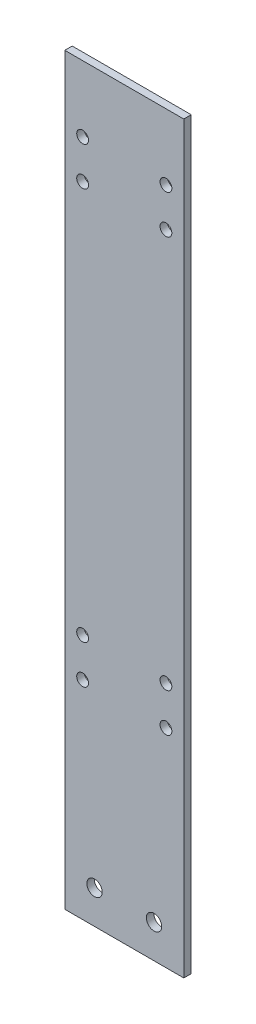
ISO-10303-21;
HEADER;
FILE_DESCRIPTION(('STEP AP214'),'2;1');
FILE_NAME('part.step','',(''),(''),'','','');
FILE_SCHEMA(('AUTOMOTIVE_DESIGN { 1 0 10303 214 1 1 1 1 }'));
ENDSEC;
DATA;
#1=APPLICATION_CONTEXT('core data for automotive mechanical design processes');
#2=APPLICATION_PROTOCOL_DEFINITION('international standard','automotive_design',2000,#1);
#3=PRODUCT_CONTEXT('',#1,'mechanical');
#4=PRODUCT('Part','Part','',(#3));
#5=PRODUCT_RELATED_PRODUCT_CATEGORY('part','',(#4));
#6=PRODUCT_DEFINITION_FORMATION('','',#4);
#7=PRODUCT_DEFINITION_CONTEXT('part definition',#1,'design');
#8=PRODUCT_DEFINITION('design','',#6,#7);
#9=PRODUCT_DEFINITION_SHAPE('','',#8);
#10=(LENGTH_UNIT() NAMED_UNIT(*) SI_UNIT(.MILLI.,.METRE.));
#11=(NAMED_UNIT(*) PLANE_ANGLE_UNIT() SI_UNIT($,.RADIAN.));
#12=(NAMED_UNIT(*) SI_UNIT($,.STERADIAN.) SOLID_ANGLE_UNIT());
#13=UNCERTAINTY_MEASURE_WITH_UNIT(LENGTH_MEASURE(1.E-05),#10,'distance_accuracy_value','');
#14=(GEOMETRIC_REPRESENTATION_CONTEXT(3) GLOBAL_UNCERTAINTY_ASSIGNED_CONTEXT((#13)) GLOBAL_UNIT_ASSIGNED_CONTEXT((#10,
#11,#12)) REPRESENTATION_CONTEXT('',''));
#15=CARTESIAN_POINT('',(0.,0.,0.));
#16=DIRECTION('',(0.,0.,1.));
#17=DIRECTION('',(1.,0.,0.));
#18=AXIS2_PLACEMENT_3D('',#15,#16,#17);
#19=CARTESIAN_POINT('',(0.,635.,0.));
#20=DIRECTION('',(1.,0.,0.));
#21=DIRECTION('',(0.,0.,-1.));
#22=AXIS2_PLACEMENT_3D('',#19,#20,#21);
#23=PLANE('',#22);
#24=DIRECTION('',(0.,0.,1.));
#25=VECTOR('',#24,1.);
#26=CARTESIAN_POINT('',(0.,0.,0.));
#27=LINE('',#26,#25);
#28=CARTESIAN_POINT('',(0.,0.,-6.35));
#29=VERTEX_POINT('',#28);
#30=CARTESIAN_POINT('',(0.,0.,0.));
#31=VERTEX_POINT('',#30);
#32=EDGE_CURVE('E112',#29,#31,#27,.T.);
#33=ORIENTED_EDGE('',*,*,#32,.T.);
#34=DIRECTION('',(0.,-1.,0.));
#35=VECTOR('',#34,1.);
#36=CARTESIAN_POINT('',(0.,635.,0.));
#37=LINE('',#36,#35);
#38=CARTESIAN_POINT('',(0.,635.,0.));
#39=VERTEX_POINT('',#38);
#40=EDGE_CURVE('E11',#39,#31,#37,.T.);
#41=ORIENTED_EDGE('',*,*,#40,.F.);
#42=DIRECTION('',(0.,0.,1.));
#43=VECTOR('',#42,1.);
#44=CARTESIAN_POINT('',(0.,635.,0.));
#45=LINE('',#44,#43);
#46=CARTESIAN_POINT('',(0.,635.,-6.35));
#47=VERTEX_POINT('',#46);
#48=EDGE_CURVE('E96',#47,#39,#45,.T.);
#49=ORIENTED_EDGE('',*,*,#48,.F.);
#50=DIRECTION('',(0.,-1.,0.));
#51=VECTOR('',#50,1.);
#52=CARTESIAN_POINT('',(0.,635.,-6.35));
#53=LINE('',#52,#51);
#54=EDGE_CURVE('E108',#47,#29,#53,.T.);
#55=ORIENTED_EDGE('',*,*,#54,.T.);
#56=EDGE_LOOP('',(#33,#41,#49,#55));
#57=FACE_BOUND('',#56,.T.);
#58=ADVANCED_FACE('F44',(#57),#23,.F.);
#59=CARTESIAN_POINT('',(0.,635.,0.));
#60=DIRECTION('',(0.,0.,-1.));
#61=DIRECTION('',(-1.,0.,0.));
#62=AXIS2_PLACEMENT_3D('',#59,#60,#61);
#63=PLANE('',#62);
#64=CARTESIAN_POINT('',(86.36,177.292,0.));
#65=DIRECTION('',(0.,0.,1.));
#66=DIRECTION('',(1.,0.,0.));
#67=AXIS2_PLACEMENT_3D('',#64,#65,#66);
#68=CIRCLE('',#67,5.0419);
#69=CARTESIAN_POINT('',(91.4019,177.292,0.));
#70=VERTEX_POINT('',#69);
#71=EDGE_CURVE('E162',#70,#70,#68,.T.);
#72=ORIENTED_EDGE('',*,*,#71,.F.);
#73=EDGE_LOOP('',(#72));
#74=FACE_BOUND('',#73,.T.);
#75=CARTESIAN_POINT('',(15.24,578.612,0.));
#76=DIRECTION('',(0.,0.,1.));
#77=DIRECTION('',(1.,0.,0.));
#78=AXIS2_PLACEMENT_3D('',#75,#76,#77);
#79=CIRCLE('',#78,5.0419);
#80=CARTESIAN_POINT('',(20.2819,578.612,0.));
#81=VERTEX_POINT('',#80);
#82=EDGE_CURVE('E177',#81,#81,#79,.T.);
#83=ORIENTED_EDGE('',*,*,#82,.F.);
#84=EDGE_LOOP('',(#83));
#85=FACE_BOUND('',#84,.T.);
#86=CARTESIAN_POINT('',(15.24,545.592,0.));
#87=DIRECTION('',(0.,0.,1.));
#88=DIRECTION('',(1.,0.,0.));
#89=AXIS2_PLACEMENT_3D('',#86,#87,#88);
#90=CIRCLE('',#89,5.0419);
#91=CARTESIAN_POINT('',(20.2819,545.592,0.));
#92=VERTEX_POINT('',#91);
#93=EDGE_CURVE('E178',#92,#92,#90,.T.);
#94=ORIENTED_EDGE('',*,*,#93,.F.);
#95=EDGE_LOOP('',(#94));
#96=FACE_BOUND('',#95,.T.);
#97=CARTESIAN_POINT('',(86.36,578.612,0.));
#98=DIRECTION('',(0.,0.,1.));
#99=DIRECTION('',(1.,0.,0.));
#100=AXIS2_PLACEMENT_3D('',#97,#98,#99);
#101=CIRCLE('',#100,5.0419);
#102=CARTESIAN_POINT('',(91.4019,578.612,0.));
#103=VERTEX_POINT('',#102);
#104=EDGE_CURVE('E193',#103,#103,#101,.T.);
#105=ORIENTED_EDGE('',*,*,#104,.F.);
#106=EDGE_LOOP('',(#105));
#107=FACE_BOUND('',#106,.T.);
#108=CARTESIAN_POINT('',(76.2,28.575,0.));
#109=DIRECTION('',(0.,0.,1.));
#110=DIRECTION('',(-1.,0.,0.));
#111=AXIS2_PLACEMENT_3D('',#108,#109,#110);
#112=CIRCLE('',#111,6.54811999999999);
#113=CARTESIAN_POINT('',(69.65188,28.575,0.));
#114=VERTEX_POINT('',#113);
#115=EDGE_CURVE('E137',#114,#114,#112,.T.);
#116=ORIENTED_EDGE('',*,*,#115,.F.);
#117=EDGE_LOOP('',(#116));
#118=FACE_BOUND('',#117,.T.);
#119=CARTESIAN_POINT('',(15.24,210.312,0.));
#120=DIRECTION('',(0.,0.,1.));
#121=DIRECTION('',(1.,0.,0.));
#122=AXIS2_PLACEMENT_3D('',#119,#120,#121);
#123=CIRCLE('',#122,5.04189999999999);
#124=CARTESIAN_POINT('',(20.2819,210.312,0.));
#125=VERTEX_POINT('',#124);
#126=EDGE_CURVE('E145',#125,#125,#123,.T.);
#127=ORIENTED_EDGE('',*,*,#126,.F.);
#128=EDGE_LOOP('',(#127));
#129=FACE_BOUND('',#128,.T.);
#130=CARTESIAN_POINT('',(86.36,210.312,0.));
#131=DIRECTION('',(0.,0.,1.));
#132=DIRECTION('',(1.,0.,0.));
#133=AXIS2_PLACEMENT_3D('',#130,#131,#132);
#134=CIRCLE('',#133,5.0419);
#135=CARTESIAN_POINT('',(91.4019,210.312,0.));
#136=VERTEX_POINT('',#135);
#137=EDGE_CURVE('E146',#136,#136,#134,.T.);
#138=ORIENTED_EDGE('',*,*,#137,.F.);
#139=EDGE_LOOP('',(#138));
#140=FACE_BOUND('',#139,.T.);
#141=CARTESIAN_POINT('',(15.24,177.292,0.));
#142=DIRECTION('',(0.,0.,1.));
#143=DIRECTION('',(1.,0.,0.));
#144=AXIS2_PLACEMENT_3D('',#141,#142,#143);
#145=CIRCLE('',#144,5.04189999999999);
#146=CARTESIAN_POINT('',(20.2819,177.292,0.));
#147=VERTEX_POINT('',#146);
#148=EDGE_CURVE('E161',#147,#147,#145,.T.);
#149=ORIENTED_EDGE('',*,*,#148,.F.);
#150=EDGE_LOOP('',(#149));
#151=FACE_BOUND('',#150,.T.);
#152=CARTESIAN_POINT('',(86.36,545.592,0.));
#153=DIRECTION('',(0.,0.,1.));
#154=DIRECTION('',(1.,0.,0.));
#155=AXIS2_PLACEMENT_3D('',#152,#153,#154);
#156=CIRCLE('',#155,5.0419);
#157=CARTESIAN_POINT('',(91.4019,545.592,0.));
#158=VERTEX_POINT('',#157);
#159=EDGE_CURVE('E194',#158,#158,#156,.T.);
#160=ORIENTED_EDGE('',*,*,#159,.F.);
#161=EDGE_LOOP('',(#160));
#162=FACE_BOUND('',#161,.T.);
#163=CARTESIAN_POINT('',(25.4,28.575,0.));
#164=DIRECTION('',(0.,0.,1.));
#165=DIRECTION('',(1.,0.,0.));
#166=AXIS2_PLACEMENT_3D('',#163,#164,#165);
#167=CIRCLE('',#166,6.54812);
#168=CARTESIAN_POINT('',(31.94812,28.575,0.));
#169=VERTEX_POINT('',#168);
#170=EDGE_CURVE('E133',#169,#169,#167,.T.);
#171=ORIENTED_EDGE('',*,*,#170,.F.);
#172=EDGE_LOOP('',(#171));
#173=FACE_BOUND('',#172,.T.);
#174=DIRECTION('',(1.,0.,0.));
#175=VECTOR('',#174,1.);
#176=CARTESIAN_POINT('',(0.,0.,0.));
#177=LINE('',#176,#175);
#178=CARTESIAN_POINT('',(101.6,0.,0.));
#179=VERTEX_POINT('',#178);
#180=EDGE_CURVE('E101',#31,#179,#177,.T.);
#181=ORIENTED_EDGE('',*,*,#180,.T.);
#182=DIRECTION('',(0.,-1.,0.));
#183=VECTOR('',#182,1.);
#184=CARTESIAN_POINT('',(101.6,635.,0.));
#185=LINE('',#184,#183);
#186=CARTESIAN_POINT('',(101.6,635.,0.));
#187=VERTEX_POINT('',#186);
#188=EDGE_CURVE('E53',#187,#179,#185,.T.);
#189=ORIENTED_EDGE('',*,*,#188,.F.);
#190=DIRECTION('',(1.,0.,0.));
#191=VECTOR('',#190,1.);
#192=CARTESIAN_POINT('',(0.,635.,0.));
#193=LINE('',#192,#191);
#194=EDGE_CURVE('E91',#39,#187,#193,.T.);
#195=ORIENTED_EDGE('',*,*,#194,.F.);
#196=ORIENTED_EDGE('',*,*,#40,.T.);
#197=EDGE_LOOP('',(#181,#189,#195,#196));
#198=FACE_BOUND('',#197,.T.);
#199=ADVANCED_FACE('F100',(#74,#85,#96,#107,#118,#129,#140,#151,#162,#173,#198),#63,.F.);
#200=CARTESIAN_POINT('',(101.6,635.,0.));
#201=DIRECTION('',(-1.,0.,0.));
#202=DIRECTION('',(0.,0.,1.));
#203=AXIS2_PLACEMENT_3D('',#200,#201,#202);
#204=PLANE('',#203);
#205=DIRECTION('',(0.,0.,-1.));
#206=VECTOR('',#205,1.);
#207=CARTESIAN_POINT('',(101.6,0.,0.));
#208=LINE('',#207,#206);
#209=CARTESIAN_POINT('',(101.6,0.,-6.35));
#210=VERTEX_POINT('',#209);
#211=EDGE_CURVE('E78',#179,#210,#208,.T.);
#212=ORIENTED_EDGE('',*,*,#211,.T.);
#213=DIRECTION('',(0.,-1.,0.));
#214=VECTOR('',#213,1.);
#215=CARTESIAN_POINT('',(101.6,635.,-6.35));
#216=LINE('',#215,#214);
#217=CARTESIAN_POINT('',(101.6,635.,-6.35));
#218=VERTEX_POINT('',#217);
#219=EDGE_CURVE('E103',#218,#210,#216,.T.);
#220=ORIENTED_EDGE('',*,*,#219,.F.);
#221=DIRECTION('',(0.,0.,-1.));
#222=VECTOR('',#221,1.);
#223=CARTESIAN_POINT('',(101.6,635.,0.));
#224=LINE('',#223,#222);
#225=EDGE_CURVE('E94',#187,#218,#224,.T.);
#226=ORIENTED_EDGE('',*,*,#225,.F.);
#227=ORIENTED_EDGE('',*,*,#188,.T.);
#228=EDGE_LOOP('',(#212,#220,#226,#227));
#229=FACE_BOUND('',#228,.T.);
#230=ADVANCED_FACE('F104',(#229),#204,.F.);
#231=CARTESIAN_POINT('',(0.,635.,-6.35));
#232=DIRECTION('',(0.,0.,1.));
#233=DIRECTION('',(1.,0.,0.));
#234=AXIS2_PLACEMENT_3D('',#231,#232,#233);
#235=PLANE('',#234);
#236=CARTESIAN_POINT('',(86.36,177.292,-6.35));
#237=DIRECTION('',(0.,0.,1.));
#238=DIRECTION('',(1.,0.,0.));
#239=AXIS2_PLACEMENT_3D('',#236,#237,#238);
#240=CIRCLE('',#239,5.0419);
#241=CARTESIAN_POINT('',(91.4019,177.292,-6.35));
#242=VERTEX_POINT('',#241);
#243=EDGE_CURVE('E182',#242,#242,#240,.T.);
#244=ORIENTED_EDGE('',*,*,#243,.T.);
#245=EDGE_LOOP('',(#244));
#246=FACE_BOUND('',#245,.T.);
#247=CARTESIAN_POINT('',(15.24,578.612,-6.35));
#248=DIRECTION('',(0.,0.,1.));
#249=DIRECTION('',(1.,0.,0.));
#250=AXIS2_PLACEMENT_3D('',#247,#248,#249);
#251=CIRCLE('',#250,5.0419);
#252=CARTESIAN_POINT('',(20.2819,578.612,-6.35));
#253=VERTEX_POINT('',#252);
#254=EDGE_CURVE('E173',#253,#253,#251,.T.);
#255=ORIENTED_EDGE('',*,*,#254,.T.);
#256=EDGE_LOOP('',(#255));
#257=FACE_BOUND('',#256,.T.);
#258=CARTESIAN_POINT('',(15.24,545.592,-6.35));
#259=DIRECTION('',(0.,0.,1.));
#260=DIRECTION('',(1.,0.,0.));
#261=AXIS2_PLACEMENT_3D('',#258,#259,#260);
#262=CIRCLE('',#261,5.0419);
#263=CARTESIAN_POINT('',(20.2819,545.592,-6.35));
#264=VERTEX_POINT('',#263);
#265=EDGE_CURVE('E198',#264,#264,#262,.T.);
#266=ORIENTED_EDGE('',*,*,#265,.T.);
#267=EDGE_LOOP('',(#266));
#268=FACE_BOUND('',#267,.T.);
#269=CARTESIAN_POINT('',(86.36,578.612,-6.35));
#270=DIRECTION('',(0.,0.,1.));
#271=DIRECTION('',(1.,0.,0.));
#272=AXIS2_PLACEMENT_3D('',#269,#270,#271);
#273=CIRCLE('',#272,5.0419);
#274=CARTESIAN_POINT('',(91.4019,578.612,-6.35));
#275=VERTEX_POINT('',#274);
#276=EDGE_CURVE('E189',#275,#275,#273,.T.);
#277=ORIENTED_EDGE('',*,*,#276,.T.);
#278=EDGE_LOOP('',(#277));
#279=FACE_BOUND('',#278,.T.);
#280=CARTESIAN_POINT('',(76.2,28.575,-6.35));
#281=DIRECTION('',(0.,0.,1.));
#282=DIRECTION('',(-1.,0.,0.));
#283=AXIS2_PLACEMENT_3D('',#280,#281,#282);
#284=CIRCLE('',#283,6.54811999999999);
#285=CARTESIAN_POINT('',(69.65188,28.575,-6.35));
#286=VERTEX_POINT('',#285);
#287=EDGE_CURVE('E150',#286,#286,#284,.T.);
#288=ORIENTED_EDGE('',*,*,#287,.T.);
#289=EDGE_LOOP('',(#288));
#290=FACE_BOUND('',#289,.T.);
#291=CARTESIAN_POINT('',(15.24,210.312,-6.35));
#292=DIRECTION('',(0.,0.,1.));
#293=DIRECTION('',(1.,0.,0.));
#294=AXIS2_PLACEMENT_3D('',#291,#292,#293);
#295=CIRCLE('',#294,5.04189999999999);
#296=CARTESIAN_POINT('',(20.2819,210.312,-6.35));
#297=VERTEX_POINT('',#296);
#298=EDGE_CURVE('E141',#297,#297,#295,.T.);
#299=ORIENTED_EDGE('',*,*,#298,.T.);
#300=EDGE_LOOP('',(#299));
#301=FACE_BOUND('',#300,.T.);
#302=CARTESIAN_POINT('',(86.36,210.312,-6.35));
#303=DIRECTION('',(0.,0.,1.));
#304=DIRECTION('',(1.,0.,0.));
#305=AXIS2_PLACEMENT_3D('',#302,#303,#304);
#306=CIRCLE('',#305,5.0419);
#307=CARTESIAN_POINT('',(91.4019,210.312,-6.35));
#308=VERTEX_POINT('',#307);
#309=EDGE_CURVE('E166',#308,#308,#306,.T.);
#310=ORIENTED_EDGE('',*,*,#309,.T.);
#311=EDGE_LOOP('',(#310));
#312=FACE_BOUND('',#311,.T.);
#313=CARTESIAN_POINT('',(15.24,177.292,-6.35));
#314=DIRECTION('',(0.,0.,1.));
#315=DIRECTION('',(1.,0.,0.));
#316=AXIS2_PLACEMENT_3D('',#313,#314,#315);
#317=CIRCLE('',#316,5.04189999999999);
#318=CARTESIAN_POINT('',(20.2819,177.292,-6.35));
#319=VERTEX_POINT('',#318);
#320=EDGE_CURVE('E157',#319,#319,#317,.T.);
#321=ORIENTED_EDGE('',*,*,#320,.T.);
#322=EDGE_LOOP('',(#321));
#323=FACE_BOUND('',#322,.T.);
#324=CARTESIAN_POINT('',(86.36,545.592,-6.35));
#325=DIRECTION('',(0.,0.,1.));
#326=DIRECTION('',(1.,0.,0.));
#327=AXIS2_PLACEMENT_3D('',#324,#325,#326);
#328=CIRCLE('',#327,5.0419);
#329=CARTESIAN_POINT('',(91.4019,545.592,-6.35));
#330=VERTEX_POINT('',#329);
#331=EDGE_CURVE('E205',#330,#330,#328,.T.);
#332=ORIENTED_EDGE('',*,*,#331,.T.);
#333=EDGE_LOOP('',(#332));
#334=FACE_BOUND('',#333,.T.);
#335=CARTESIAN_POINT('',(25.4,28.575,-6.35));
#336=DIRECTION('',(0.,0.,1.));
#337=DIRECTION('',(1.,0.,0.));
#338=AXIS2_PLACEMENT_3D('',#335,#336,#337);
#339=CIRCLE('',#338,6.54812);
#340=CARTESIAN_POINT('',(31.94812,28.575,-6.35));
#341=VERTEX_POINT('',#340);
#342=EDGE_CURVE('E116',#341,#341,#339,.T.);
#343=ORIENTED_EDGE('',*,*,#342,.T.);
#344=EDGE_LOOP('',(#343));
#345=FACE_BOUND('',#344,.T.);
#346=DIRECTION('',(-1.,0.,0.));
#347=VECTOR('',#346,1.);
#348=CARTESIAN_POINT('',(0.,0.,-6.35));
#349=LINE('',#348,#347);
#350=EDGE_CURVE('E84',#210,#29,#349,.T.);
#351=ORIENTED_EDGE('',*,*,#350,.T.);
#352=ORIENTED_EDGE('',*,*,#54,.F.);
#353=DIRECTION('',(-1.,0.,0.));
#354=VECTOR('',#353,1.);
#355=CARTESIAN_POINT('',(0.,635.,-6.35));
#356=LINE('',#355,#354);
#357=EDGE_CURVE('E61',#218,#47,#356,.T.);
#358=ORIENTED_EDGE('',*,*,#357,.F.);
#359=ORIENTED_EDGE('',*,*,#219,.T.);
#360=EDGE_LOOP('',(#351,#352,#358,#359));
#361=FACE_BOUND('',#360,.T.);
#362=ADVANCED_FACE('F126',(#246,#257,#268,#279,#290,#301,#312,#323,#334,#345,#361),#235,.F.);
#363=CARTESIAN_POINT('',(0.,635.,0.));
#364=DIRECTION('',(0.,-1.,0.));
#365=DIRECTION('',(0.,0.,-1.));
#366=AXIS2_PLACEMENT_3D('',#363,#364,#365);
#367=PLANE('',#366);
#368=ORIENTED_EDGE('',*,*,#48,.T.);
#369=ORIENTED_EDGE('',*,*,#194,.T.);
#370=ORIENTED_EDGE('',*,*,#225,.T.);
#371=ORIENTED_EDGE('',*,*,#357,.T.);
#372=EDGE_LOOP('',(#368,#369,#370,#371));
#373=FACE_BOUND('',#372,.T.);
#374=ADVANCED_FACE('F92',(#373),#367,.F.);
#375=CARTESIAN_POINT('',(0.,0.,0.));
#376=DIRECTION('',(0.,-1.,0.));
#377=DIRECTION('',(0.,0.,-1.));
#378=AXIS2_PLACEMENT_3D('',#375,#376,#377);
#379=PLANE('',#378);
#380=ORIENTED_EDGE('',*,*,#32,.F.);
#381=ORIENTED_EDGE('',*,*,#350,.F.);
#382=ORIENTED_EDGE('',*,*,#211,.F.);
#383=ORIENTED_EDGE('',*,*,#180,.F.);
#384=EDGE_LOOP('',(#380,#381,#382,#383));
#385=FACE_BOUND('',#384,.T.);
#386=ADVANCED_FACE('F129',(#385),#379,.T.);
#387=CARTESIAN_POINT('',(25.4,28.575,-6.35));
#388=DIRECTION('',(0.,0.,1.));
#389=DIRECTION('',(1.,0.,0.));
#390=AXIS2_PLACEMENT_3D('',#387,#388,#389);
#391=CYLINDRICAL_SURFACE('',#390,6.54812);
#392=ORIENTED_EDGE('',*,*,#342,.F.);
#393=EDGE_LOOP('',(#392));
#394=FACE_BOUND('',#393,.T.);
#395=ORIENTED_EDGE('',*,*,#170,.T.);
#396=EDGE_LOOP('',(#395));
#397=FACE_BOUND('',#396,.T.);
#398=ADVANCED_FACE('F220',(#394,#397),#391,.F.);
#399=CARTESIAN_POINT('',(86.36,545.592,-6.35));
#400=DIRECTION('',(0.,0.,1.));
#401=DIRECTION('',(1.,0.,0.));
#402=AXIS2_PLACEMENT_3D('',#399,#400,#401);
#403=CYLINDRICAL_SURFACE('',#402,5.0419);
#404=ORIENTED_EDGE('',*,*,#331,.F.);
#405=EDGE_LOOP('',(#404));
#406=FACE_BOUND('',#405,.T.);
#407=ORIENTED_EDGE('',*,*,#159,.T.);
#408=EDGE_LOOP('',(#407));
#409=FACE_BOUND('',#408,.T.);
#410=ADVANCED_FACE('F213',(#406,#409),#403,.F.);
#411=CARTESIAN_POINT('',(15.24,177.292,-6.35));
#412=DIRECTION('',(0.,0.,1.));
#413=DIRECTION('',(1.,0.,0.));
#414=AXIS2_PLACEMENT_3D('',#411,#412,#413);
#415=CYLINDRICAL_SURFACE('',#414,5.04189999999999);
#416=ORIENTED_EDGE('',*,*,#320,.F.);
#417=EDGE_LOOP('',(#416));
#418=FACE_BOUND('',#417,.T.);
#419=ORIENTED_EDGE('',*,*,#148,.T.);
#420=EDGE_LOOP('',(#419));
#421=FACE_BOUND('',#420,.T.);
#422=ADVANCED_FACE('F228',(#418,#421),#415,.F.);
#423=CARTESIAN_POINT('',(86.36,210.312,-6.35));
#424=DIRECTION('',(0.,0.,1.));
#425=DIRECTION('',(1.,0.,0.));
#426=AXIS2_PLACEMENT_3D('',#423,#424,#425);
#427=CYLINDRICAL_SURFACE('',#426,5.0419);
#428=ORIENTED_EDGE('',*,*,#309,.F.);
#429=EDGE_LOOP('',(#428));
#430=FACE_BOUND('',#429,.T.);
#431=ORIENTED_EDGE('',*,*,#137,.T.);
#432=EDGE_LOOP('',(#431));
#433=FACE_BOUND('',#432,.T.);
#434=ADVANCED_FACE('F290',(#430,#433),#427,.F.);
#435=CARTESIAN_POINT('',(15.24,210.312,-6.35));
#436=DIRECTION('',(0.,0.,1.));
#437=DIRECTION('',(1.,0.,0.));
#438=AXIS2_PLACEMENT_3D('',#435,#436,#437);
#439=CYLINDRICAL_SURFACE('',#438,5.04189999999999);
#440=ORIENTED_EDGE('',*,*,#298,.F.);
#441=EDGE_LOOP('',(#440));
#442=FACE_BOUND('',#441,.T.);
#443=ORIENTED_EDGE('',*,*,#126,.T.);
#444=EDGE_LOOP('',(#443));
#445=FACE_BOUND('',#444,.T.);
#446=ADVANCED_FACE('F299',(#442,#445),#439,.F.);
#447=CARTESIAN_POINT('',(76.2,28.575,-6.35));
#448=DIRECTION('',(0.,0.,1.));
#449=DIRECTION('',(1.,0.,0.));
#450=AXIS2_PLACEMENT_3D('',#447,#448,#449);
#451=CYLINDRICAL_SURFACE('',#450,6.54811999999999);
#452=ORIENTED_EDGE('',*,*,#287,.F.);
#453=EDGE_LOOP('',(#452));
#454=FACE_BOUND('',#453,.T.);
#455=ORIENTED_EDGE('',*,*,#115,.T.);
#456=EDGE_LOOP('',(#455));
#457=FACE_BOUND('',#456,.T.);
#458=ADVANCED_FACE('F308',(#454,#457),#451,.F.);
#459=CARTESIAN_POINT('',(86.36,578.612,-6.35));
#460=DIRECTION('',(0.,0.,1.));
#461=DIRECTION('',(1.,0.,0.));
#462=AXIS2_PLACEMENT_3D('',#459,#460,#461);
#463=CYLINDRICAL_SURFACE('',#462,5.0419);
#464=ORIENTED_EDGE('',*,*,#276,.F.);
#465=EDGE_LOOP('',(#464));
#466=FACE_BOUND('',#465,.T.);
#467=ORIENTED_EDGE('',*,*,#104,.T.);
#468=EDGE_LOOP('',(#467));
#469=FACE_BOUND('',#468,.T.);
#470=ADVANCED_FACE('F316',(#466,#469),#463,.F.);
#471=CARTESIAN_POINT('',(15.24,545.592,-6.35));
#472=DIRECTION('',(0.,0.,1.));
#473=DIRECTION('',(1.,0.,0.));
#474=AXIS2_PLACEMENT_3D('',#471,#472,#473);
#475=CYLINDRICAL_SURFACE('',#474,5.0419);
#476=ORIENTED_EDGE('',*,*,#265,.F.);
#477=EDGE_LOOP('',(#476));
#478=FACE_BOUND('',#477,.T.);
#479=ORIENTED_EDGE('',*,*,#93,.T.);
#480=EDGE_LOOP('',(#479));
#481=FACE_BOUND('',#480,.T.);
#482=ADVANCED_FACE('F325',(#478,#481),#475,.F.);
#483=CARTESIAN_POINT('',(15.24,578.612,-6.35));
#484=DIRECTION('',(0.,0.,1.));
#485=DIRECTION('',(1.,0.,0.));
#486=AXIS2_PLACEMENT_3D('',#483,#484,#485);
#487=CYLINDRICAL_SURFACE('',#486,5.0419);
#488=ORIENTED_EDGE('',*,*,#254,.F.);
#489=EDGE_LOOP('',(#488));
#490=FACE_BOUND('',#489,.T.);
#491=ORIENTED_EDGE('',*,*,#82,.T.);
#492=EDGE_LOOP('',(#491));
#493=FACE_BOUND('',#492,.T.);
#494=ADVANCED_FACE('F334',(#490,#493),#487,.F.);
#495=CARTESIAN_POINT('',(86.36,177.292,-6.35));
#496=DIRECTION('',(0.,0.,1.));
#497=DIRECTION('',(1.,0.,0.));
#498=AXIS2_PLACEMENT_3D('',#495,#496,#497);
#499=CYLINDRICAL_SURFACE('',#498,5.0419);
#500=ORIENTED_EDGE('',*,*,#243,.F.);
#501=EDGE_LOOP('',(#500));
#502=FACE_BOUND('',#501,.T.);
#503=ORIENTED_EDGE('',*,*,#71,.T.);
#504=EDGE_LOOP('',(#503));
#505=FACE_BOUND('',#504,.T.);
#506=ADVANCED_FACE('F343',(#502,#505),#499,.F.);
#507=CLOSED_SHELL('',(#58,#199,#230,#362,#374,#386,#398,#410,#422,#434,#446,#458,#470,#482,#494,#506));
#508=MANIFOLD_SOLID_BREP('B2',#507);
#509=ADVANCED_BREP_SHAPE_REPRESENTATION('',(#18,#508),#14);
#510=SHAPE_DEFINITION_REPRESENTATION(#9,#509);
ENDSEC;
END-ISO-10303-21;
